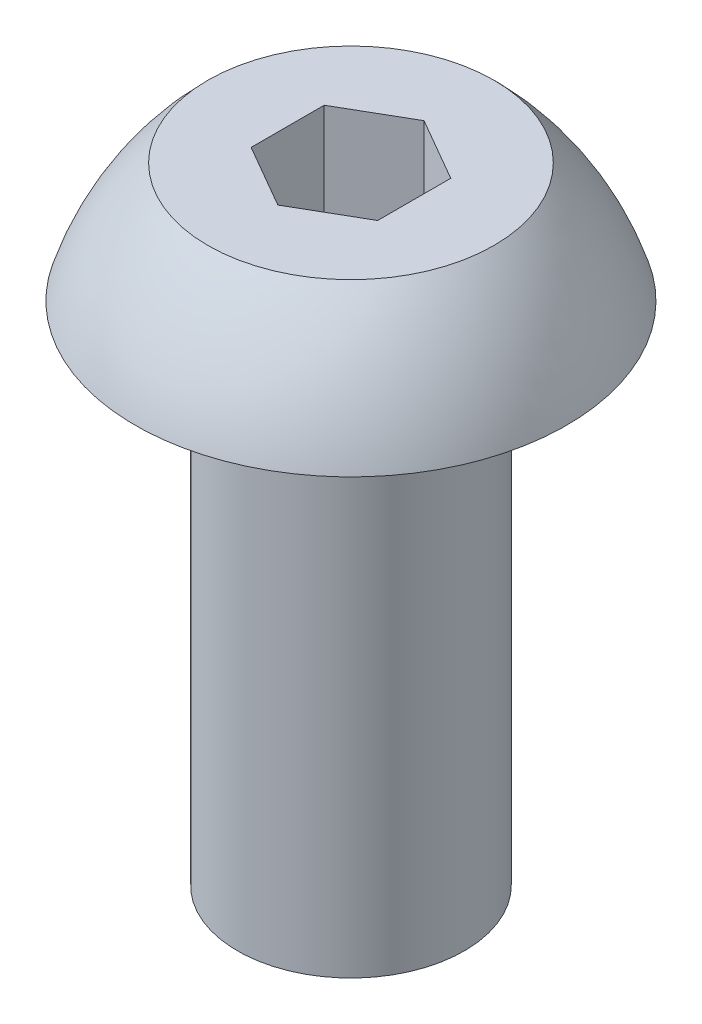
ISO-10303-21;
HEADER;
FILE_DESCRIPTION(('STEP AP214'),'2;1');
FILE_NAME('part.step','',(''),(''),'','','');
FILE_SCHEMA(('AUTOMOTIVE_DESIGN { 1 0 10303 214 1 1 1 1 }'));
ENDSEC;
DATA;
#1=APPLICATION_CONTEXT('core data for automotive mechanical design processes');
#2=APPLICATION_PROTOCOL_DEFINITION('international standard','automotive_design',2000,#1);
#3=PRODUCT_CONTEXT('',#1,'mechanical');
#4=PRODUCT('Part','Part','',(#3));
#5=PRODUCT_RELATED_PRODUCT_CATEGORY('part','',(#4));
#6=PRODUCT_DEFINITION_FORMATION('','',#4);
#7=PRODUCT_DEFINITION_CONTEXT('part definition',#1,'design');
#8=PRODUCT_DEFINITION('design','',#6,#7);
#9=PRODUCT_DEFINITION_SHAPE('','',#8);
#10=(LENGTH_UNIT() NAMED_UNIT(*) SI_UNIT(.MILLI.,.METRE.));
#11=(NAMED_UNIT(*) PLANE_ANGLE_UNIT() SI_UNIT($,.RADIAN.));
#12=(NAMED_UNIT(*) SI_UNIT($,.STERADIAN.) SOLID_ANGLE_UNIT());
#13=UNCERTAINTY_MEASURE_WITH_UNIT(LENGTH_MEASURE(1.E-05),#10,'distance_accuracy_value','');
#14=(GEOMETRIC_REPRESENTATION_CONTEXT(3) GLOBAL_UNCERTAINTY_ASSIGNED_CONTEXT((#13)) GLOBAL_UNIT_ASSIGNED_CONTEXT((#10,
#11,#12)) REPRESENTATION_CONTEXT('',''));
#15=CARTESIAN_POINT('',(0.,0.,0.));
#16=DIRECTION('',(0.,0.,1.));
#17=DIRECTION('',(1.,0.,0.));
#18=AXIS2_PLACEMENT_3D('',#15,#16,#17);
#19=CARTESIAN_POINT('',(0.,-6.35,0.));
#20=DIRECTION('',(0.,-1.,0.));
#21=DIRECTION('',(0.,0.,-1.));
#22=AXIS2_PLACEMENT_3D('',#19,#20,#21);
#23=CYLINDRICAL_SURFACE('',#22,1.4224);
#24=CARTESIAN_POINT('',(0.,-6.35,0.));
#25=DIRECTION('',(0.,-1.,0.));
#26=DIRECTION('',(0.,0.,-1.));
#27=AXIS2_PLACEMENT_3D('',#24,#25,#26);
#28=CIRCLE('',#27,1.4224);
#29=CARTESIAN_POINT('',(0.,-6.35,-1.4224));
#30=VERTEX_POINT('',#29);
#31=EDGE_CURVE('E135',#30,#30,#28,.T.);
#32=ORIENTED_EDGE('',*,*,#31,.F.);
#33=EDGE_LOOP('',(#32));
#34=FACE_BOUND('',#33,.T.);
#35=CARTESIAN_POINT('',(0.,0.,0.));
#36=DIRECTION('',(0.,-1.,0.));
#37=DIRECTION('',(0.,0.,-1.));
#38=AXIS2_PLACEMENT_3D('',#35,#36,#37);
#39=CIRCLE('',#38,1.4224);
#40=CARTESIAN_POINT('',(0.,0.,-1.4224));
#41=VERTEX_POINT('',#40);
#42=EDGE_CURVE('E11',#41,#41,#39,.T.);
#43=ORIENTED_EDGE('',*,*,#42,.T.);
#44=EDGE_LOOP('',(#43));
#45=FACE_BOUND('',#44,.T.);
#46=ADVANCED_FACE('F34',(#34,#45),#23,.T.);
#47=CARTESIAN_POINT('',(-1.4224,0.,0.));
#48=DIRECTION('',(0.,1.,0.));
#49=DIRECTION('',(0.,0.,1.));
#50=AXIS2_PLACEMENT_3D('',#47,#48,#49);
#51=PLANE('',#50);
#52=ORIENTED_EDGE('',*,*,#42,.F.);
#53=EDGE_LOOP('',(#52));
#54=FACE_BOUND('',#53,.T.);
#55=CARTESIAN_POINT('',(0.,0.,0.));
#56=DIRECTION('',(0.,-1.,0.));
#57=DIRECTION('',(0.,0.,-1.));
#58=AXIS2_PLACEMENT_3D('',#55,#56,#57);
#59=CIRCLE('',#58,2.7051);
#60=CARTESIAN_POINT('',(0.,0.,-2.7051));
#61=VERTEX_POINT('',#60);
#62=EDGE_CURVE('E41',#61,#61,#59,.T.);
#63=ORIENTED_EDGE('',*,*,#62,.T.);
#64=EDGE_LOOP('',(#63));
#65=FACE_BOUND('',#64,.T.);
#66=ADVANCED_FACE('F148',(#54,#65),#51,.F.);
#67=CARTESIAN_POINT('',(0.,-1.04271365415663,0.));
#68=DIRECTION('',(0.,-1.,0.));
#69=DIRECTION('',(0.,0.,-1.));
#70=AXIS2_PLACEMENT_3D('',#67,#68,#69);
#71=DEGENERATE_TOROIDAL_SURFACE('',#70,0.700107002516782,3.5612759643917,.F.);
#72=ORIENTED_EDGE('',*,*,#62,.F.);
#73=EDGE_LOOP('',(#72));
#74=FACE_BOUND('',#73,.T.);
#75=CARTESIAN_POINT('',(0.,1.4986,0.));
#76=DIRECTION('',(0.,-1.,0.));
#77=DIRECTION('',(0.,0.,-1.));
#78=AXIS2_PLACEMENT_3D('',#75,#76,#77);
#79=CIRCLE('',#78,1.7947700296736);
#80=CARTESIAN_POINT('',(0.,1.4986,-1.7947700296736));
#81=VERTEX_POINT('',#80);
#82=EDGE_CURVE('E143',#81,#81,#79,.T.);
#83=ORIENTED_EDGE('',*,*,#82,.T.);
#84=EDGE_LOOP('',(#83));
#85=FACE_BOUND('',#84,.T.);
#86=ADVANCED_FACE('F150',(#74,#85),#71,.F.);
#87=CARTESIAN_POINT('',(0.,1.4986,0.));
#88=DIRECTION('',(0.,-1.,0.));
#89=DIRECTION('',(0.,0.,-1.));
#90=AXIS2_PLACEMENT_3D('',#87,#88,#89);
#91=PLANE('',#90);
#92=DIRECTION('',(0.,0.,1.));
#93=VECTOR('',#92,1.);
#94=CARTESIAN_POINT('',(-0.79375,1.4986,-0.458271776169265));
#95=LINE('',#94,#93);
#96=CARTESIAN_POINT('',(-0.79375,1.4986,-0.458271776169265));
#97=VERTEX_POINT('',#96);
#98=CARTESIAN_POINT('',(-0.79375,1.4986,0.458271776169266));
#99=VERTEX_POINT('',#98);
#100=EDGE_CURVE('E122',#97,#99,#95,.T.);
#101=ORIENTED_EDGE('',*,*,#100,.F.);
#102=DIRECTION('',(-0.866025403784438,0.,0.5));
#103=VECTOR('',#102,1.);
#104=CARTESIAN_POINT('',(0.,1.4986,-0.916543552338531));
#105=LINE('',#104,#103);
#106=CARTESIAN_POINT('',(0.,1.4986,-0.916543552338531));
#107=VERTEX_POINT('',#106);
#108=EDGE_CURVE('E48',#107,#97,#105,.T.);
#109=ORIENTED_EDGE('',*,*,#108,.F.);
#110=DIRECTION('',(-0.866025403784439,0.,-0.5));
#111=VECTOR('',#110,1.);
#112=CARTESIAN_POINT('',(0.79375,1.4986,-0.458271776169266));
#113=LINE('',#112,#111);
#114=CARTESIAN_POINT('',(0.79375,1.4986,-0.458271776169266));
#115=VERTEX_POINT('',#114);
#116=EDGE_CURVE('E131',#115,#107,#113,.T.);
#117=ORIENTED_EDGE('',*,*,#116,.F.);
#118=DIRECTION('',(0.,0.,-1.));
#119=VECTOR('',#118,1.);
#120=CARTESIAN_POINT('',(0.79375,1.4986,0.458271776169265));
#121=LINE('',#120,#119);
#122=CARTESIAN_POINT('',(0.79375,1.4986,0.458271776169265));
#123=VERTEX_POINT('',#122);
#124=EDGE_CURVE('E129',#123,#115,#121,.T.);
#125=ORIENTED_EDGE('',*,*,#124,.F.);
#126=DIRECTION('',(0.866025403784439,0.,-0.5));
#127=VECTOR('',#126,1.);
#128=CARTESIAN_POINT('',(0.,1.4986,0.916543552338531));
#129=LINE('',#128,#127);
#130=CARTESIAN_POINT('',(0.,1.4986,0.916543552338531));
#131=VERTEX_POINT('',#130);
#132=EDGE_CURVE('E96',#131,#123,#129,.T.);
#133=ORIENTED_EDGE('',*,*,#132,.F.);
#134=DIRECTION('',(0.866025403784439,0.,0.5));
#135=VECTOR('',#134,1.);
#136=CARTESIAN_POINT('',(-0.79375,1.4986,0.458271776169266));
#137=LINE('',#136,#135);
#138=EDGE_CURVE('E125',#99,#131,#137,.T.);
#139=ORIENTED_EDGE('',*,*,#138,.F.);
#140=EDGE_LOOP('',(#101,#109,#117,#125,#133,#139));
#141=FACE_BOUND('',#140,.T.);
#142=ORIENTED_EDGE('',*,*,#82,.F.);
#143=EDGE_LOOP('',(#142));
#144=FACE_BOUND('',#143,.T.);
#145=ADVANCED_FACE('F153',(#141,#144),#91,.F.);
#146=CARTESIAN_POINT('',(-1.4224,-6.35,0.));
#147=DIRECTION('',(0.,1.,0.));
#148=DIRECTION('',(0.,0.,1.));
#149=AXIS2_PLACEMENT_3D('',#146,#147,#148);
#150=PLANE('',#149);
#151=ORIENTED_EDGE('',*,*,#31,.T.);
#152=EDGE_LOOP('',(#151));
#153=FACE_BOUND('',#152,.T.);
#154=ADVANCED_FACE('F158',(#153),#150,.F.);
#155=CARTESIAN_POINT('',(0.,0.2286,-0.916543552338531));
#156=DIRECTION('',(-0.5,0.,-0.866025403784438));
#157=DIRECTION('',(-0.866025403784439,0.,0.5));
#158=AXIS2_PLACEMENT_3D('',#155,#156,#157);
#159=PLANE('',#158);
#160=ORIENTED_EDGE('',*,*,#108,.T.);
#161=DIRECTION('',(0.,1.,0.));
#162=VECTOR('',#161,1.);
#163=CARTESIAN_POINT('',(-0.79375,0.2286,-0.458271776169265));
#164=LINE('',#163,#162);
#165=CARTESIAN_POINT('',(-0.79375,0.2286,-0.458271776169265));
#166=VERTEX_POINT('',#165);
#167=EDGE_CURVE('E78',#166,#97,#164,.T.);
#168=ORIENTED_EDGE('',*,*,#167,.F.);
#169=DIRECTION('',(-0.866025403784438,0.,0.5));
#170=VECTOR('',#169,1.);
#171=CARTESIAN_POINT('',(0.,0.2286,-0.916543552338531));
#172=LINE('',#171,#170);
#173=CARTESIAN_POINT('',(0.,0.2286,-0.916543552338531));
#174=VERTEX_POINT('',#173);
#175=EDGE_CURVE('E133',#174,#166,#172,.T.);
#176=ORIENTED_EDGE('',*,*,#175,.F.);
#177=DIRECTION('',(0.,1.,0.));
#178=VECTOR('',#177,1.);
#179=CARTESIAN_POINT('',(0.,0.2286,-0.916543552338531));
#180=LINE('',#179,#178);
#181=EDGE_CURVE('E56',#174,#107,#180,.T.);
#182=ORIENTED_EDGE('',*,*,#181,.T.);
#183=EDGE_LOOP('',(#160,#168,#176,#182));
#184=FACE_BOUND('',#183,.T.);
#185=ADVANCED_FACE('F164',(#184),#159,.F.);
#186=CARTESIAN_POINT('',(0.79375,0.2286,-0.458271776169266));
#187=DIRECTION('',(0.5,0.,-0.866025403784439));
#188=DIRECTION('',(-0.866025403784439,0.,-0.5));
#189=AXIS2_PLACEMENT_3D('',#186,#187,#188);
#190=PLANE('',#189);
#191=ORIENTED_EDGE('',*,*,#116,.T.);
#192=ORIENTED_EDGE('',*,*,#181,.F.);
#193=DIRECTION('',(-0.866025403784439,0.,-0.5));
#194=VECTOR('',#193,1.);
#195=CARTESIAN_POINT('',(0.79375,0.2286,-0.458271776169266));
#196=LINE('',#195,#194);
#197=CARTESIAN_POINT('',(0.79375,0.2286,-0.458271776169266));
#198=VERTEX_POINT('',#197);
#199=EDGE_CURVE('E108',#198,#174,#196,.T.);
#200=ORIENTED_EDGE('',*,*,#199,.F.);
#201=DIRECTION('',(0.,1.,0.));
#202=VECTOR('',#201,1.);
#203=CARTESIAN_POINT('',(0.79375,0.2286,-0.458271776169266));
#204=LINE('',#203,#202);
#205=EDGE_CURVE('E100',#198,#115,#204,.T.);
#206=ORIENTED_EDGE('',*,*,#205,.T.);
#207=EDGE_LOOP('',(#191,#192,#200,#206));
#208=FACE_BOUND('',#207,.T.);
#209=ADVANCED_FACE('F202',(#208),#190,.F.);
#210=CARTESIAN_POINT('',(0.79375,0.2286,0.458271776169265));
#211=DIRECTION('',(1.,0.,0.));
#212=DIRECTION('',(0.,0.,-1.));
#213=AXIS2_PLACEMENT_3D('',#210,#211,#212);
#214=PLANE('',#213);
#215=ORIENTED_EDGE('',*,*,#124,.T.);
#216=ORIENTED_EDGE('',*,*,#205,.F.);
#217=DIRECTION('',(0.,0.,-1.));
#218=VECTOR('',#217,1.);
#219=CARTESIAN_POINT('',(0.79375,0.2286,0.458271776169265));
#220=LINE('',#219,#218);
#221=CARTESIAN_POINT('',(0.79375,0.2286,0.458271776169265));
#222=VERTEX_POINT('',#221);
#223=EDGE_CURVE('E104',#222,#198,#220,.T.);
#224=ORIENTED_EDGE('',*,*,#223,.F.);
#225=DIRECTION('',(0.,1.,0.));
#226=VECTOR('',#225,1.);
#227=CARTESIAN_POINT('',(0.79375,0.2286,0.458271776169265));
#228=LINE('',#227,#226);
#229=EDGE_CURVE('E89',#222,#123,#228,.T.);
#230=ORIENTED_EDGE('',*,*,#229,.T.);
#231=EDGE_LOOP('',(#215,#216,#224,#230));
#232=FACE_BOUND('',#231,.T.);
#233=ADVANCED_FACE('F105',(#232),#214,.F.);
#234=CARTESIAN_POINT('',(0.,0.2286,0.916543552338531));
#235=DIRECTION('',(0.5,0.,0.866025403784439));
#236=DIRECTION('',(0.866025403784439,0.,-0.5));
#237=AXIS2_PLACEMENT_3D('',#234,#235,#236);
#238=PLANE('',#237);
#239=ORIENTED_EDGE('',*,*,#132,.T.);
#240=ORIENTED_EDGE('',*,*,#229,.F.);
#241=DIRECTION('',(0.866025403784439,0.,-0.5));
#242=VECTOR('',#241,1.);
#243=CARTESIAN_POINT('',(0.,0.2286,0.916543552338531));
#244=LINE('',#243,#242);
#245=CARTESIAN_POINT('',(0.,0.2286,0.916543552338531));
#246=VERTEX_POINT('',#245);
#247=EDGE_CURVE('E93',#246,#222,#244,.T.);
#248=ORIENTED_EDGE('',*,*,#247,.F.);
#249=DIRECTION('',(0.,1.,0.));
#250=VECTOR('',#249,1.);
#251=CARTESIAN_POINT('',(0.,0.2286,0.916543552338531));
#252=LINE('',#251,#250);
#253=EDGE_CURVE('E101',#246,#131,#252,.T.);
#254=ORIENTED_EDGE('',*,*,#253,.T.);
#255=EDGE_LOOP('',(#239,#240,#248,#254));
#256=FACE_BOUND('',#255,.T.);
#257=ADVANCED_FACE('F91',(#256),#238,.F.);
#258=CARTESIAN_POINT('',(-0.79375,0.2286,0.458271776169266));
#259=DIRECTION('',(-0.5,0.,0.866025403784439));
#260=DIRECTION('',(0.866025403784439,0.,0.5));
#261=AXIS2_PLACEMENT_3D('',#258,#259,#260);
#262=PLANE('',#261);
#263=ORIENTED_EDGE('',*,*,#138,.T.);
#264=ORIENTED_EDGE('',*,*,#253,.F.);
#265=DIRECTION('',(0.866025403784439,0.,0.5));
#266=VECTOR('',#265,1.);
#267=CARTESIAN_POINT('',(-0.79375,0.2286,0.458271776169266));
#268=LINE('',#267,#266);
#269=CARTESIAN_POINT('',(-0.79375,0.2286,0.458271776169266));
#270=VERTEX_POINT('',#269);
#271=EDGE_CURVE('E114',#270,#246,#268,.T.);
#272=ORIENTED_EDGE('',*,*,#271,.F.);
#273=DIRECTION('',(0.,1.,0.));
#274=VECTOR('',#273,1.);
#275=CARTESIAN_POINT('',(-0.79375,0.2286,0.458271776169266));
#276=LINE('',#275,#274);
#277=EDGE_CURVE('E138',#270,#99,#276,.T.);
#278=ORIENTED_EDGE('',*,*,#277,.T.);
#279=EDGE_LOOP('',(#263,#264,#272,#278));
#280=FACE_BOUND('',#279,.T.);
#281=ADVANCED_FACE('F227',(#280),#262,.F.);
#282=CARTESIAN_POINT('',(-0.79375,0.2286,-0.458271776169265));
#283=DIRECTION('',(-1.,0.,0.));
#284=DIRECTION('',(0.,0.,1.));
#285=AXIS2_PLACEMENT_3D('',#282,#283,#284);
#286=PLANE('',#285);
#287=ORIENTED_EDGE('',*,*,#100,.T.);
#288=ORIENTED_EDGE('',*,*,#277,.F.);
#289=DIRECTION('',(0.,0.,1.));
#290=VECTOR('',#289,1.);
#291=CARTESIAN_POINT('',(-0.79375,0.2286,-0.458271776169265));
#292=LINE('',#291,#290);
#293=EDGE_CURVE('E116',#166,#270,#292,.T.);
#294=ORIENTED_EDGE('',*,*,#293,.F.);
#295=ORIENTED_EDGE('',*,*,#167,.T.);
#296=EDGE_LOOP('',(#287,#288,#294,#295));
#297=FACE_BOUND('',#296,.T.);
#298=ADVANCED_FACE('F236',(#297),#286,.F.);
#299=CARTESIAN_POINT('',(0.,0.2286,0.));
#300=DIRECTION('',(0.,1.,0.));
#301=DIRECTION('',(0.,0.,1.));
#302=AXIS2_PLACEMENT_3D('',#299,#300,#301);
#303=PLANE('',#302);
#304=ORIENTED_EDGE('',*,*,#175,.T.);
#305=ORIENTED_EDGE('',*,*,#293,.T.);
#306=ORIENTED_EDGE('',*,*,#271,.T.);
#307=ORIENTED_EDGE('',*,*,#247,.T.);
#308=ORIENTED_EDGE('',*,*,#223,.T.);
#309=ORIENTED_EDGE('',*,*,#199,.T.);
#310=EDGE_LOOP('',(#304,#305,#306,#307,#308,#309));
#311=FACE_BOUND('',#310,.T.);
#312=ADVANCED_FACE('F111',(#311),#303,.T.);
#313=CLOSED_SHELL('',(#46,#66,#86,#145,#154,#185,#209,#233,#257,#281,#298,#312));
#314=MANIFOLD_SOLID_BREP('B2',#313);
#315=ADVANCED_BREP_SHAPE_REPRESENTATION('',(#18,#314),#14);
#316=SHAPE_DEFINITION_REPRESENTATION(#9,#315);
ENDSEC;
END-ISO-10303-21;
